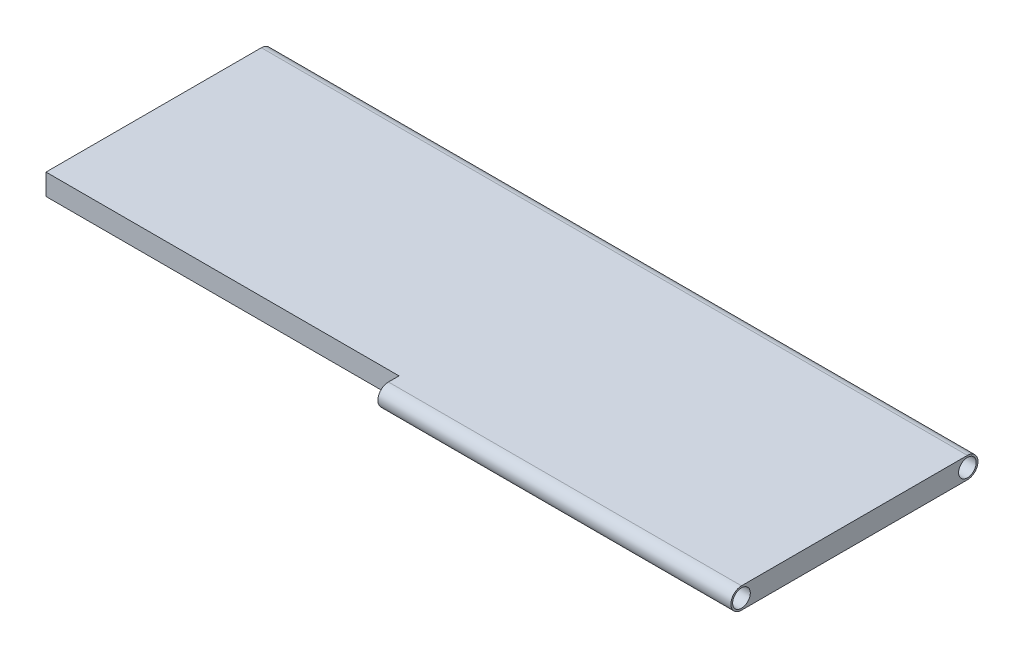
ISO-10303-21;
HEADER;
FILE_DESCRIPTION(('STEP AP214'),'2;1');
FILE_NAME('part.step','',(''),(''),'','','');
FILE_SCHEMA(('AUTOMOTIVE_DESIGN { 1 0 10303 214 1 1 1 1 }'));
ENDSEC;
DATA;
#1=APPLICATION_CONTEXT('core data for automotive mechanical design processes');
#2=APPLICATION_PROTOCOL_DEFINITION('international standard','automotive_design',2000,#1);
#3=PRODUCT_CONTEXT('',#1,'mechanical');
#4=PRODUCT('Part','Part','',(#3));
#5=PRODUCT_RELATED_PRODUCT_CATEGORY('part','',(#4));
#6=PRODUCT_DEFINITION_FORMATION('','',#4);
#7=PRODUCT_DEFINITION_CONTEXT('part definition',#1,'design');
#8=PRODUCT_DEFINITION('design','',#6,#7);
#9=PRODUCT_DEFINITION_SHAPE('','',#8);
#10=(LENGTH_UNIT() NAMED_UNIT(*) SI_UNIT(.MILLI.,.METRE.));
#11=(NAMED_UNIT(*) PLANE_ANGLE_UNIT() SI_UNIT($,.RADIAN.));
#12=(NAMED_UNIT(*) SI_UNIT($,.STERADIAN.) SOLID_ANGLE_UNIT());
#13=UNCERTAINTY_MEASURE_WITH_UNIT(LENGTH_MEASURE(1.E-05),#10,'distance_accuracy_value','');
#14=(GEOMETRIC_REPRESENTATION_CONTEXT(3) GLOBAL_UNCERTAINTY_ASSIGNED_CONTEXT((#13)) GLOBAL_UNIT_ASSIGNED_CONTEXT((#10,
#11,#12)) REPRESENTATION_CONTEXT('',''));
#15=CARTESIAN_POINT('',(0.,0.,0.));
#16=DIRECTION('',(0.,0.,1.));
#17=DIRECTION('',(1.,0.,0.));
#18=AXIS2_PLACEMENT_3D('',#15,#16,#17);
#19=CARTESIAN_POINT('',(-500.,30.,145.));
#20=DIRECTION('',(0.,0.,-1.));
#21=DIRECTION('',(-1.,0.,0.));
#22=AXIS2_PLACEMENT_3D('',#19,#20,#21);
#23=PLANE('',#22);
#24=DIRECTION('',(0.,-1.,0.));
#25=VECTOR('',#24,1.);
#26=CARTESIAN_POINT('',(0.,0.,145.));
#27=LINE('',#26,#25);
#28=CARTESIAN_POINT('',(0.,30.,145.));
#29=VERTEX_POINT('',#28);
#30=CARTESIAN_POINT('',(0.,0.,145.));
#31=VERTEX_POINT('',#30);
#32=EDGE_CURVE('E51',#29,#31,#27,.T.);
#33=ORIENTED_EDGE('',*,*,#32,.F.);
#34=DIRECTION('',(1.,0.,0.));
#35=VECTOR('',#34,1.);
#36=CARTESIAN_POINT('',(-500.,30.,145.));
#37=LINE('',#36,#35);
#38=CARTESIAN_POINT('',(-500.,30.,145.));
#39=VERTEX_POINT('',#38);
#40=EDGE_CURVE('E44',#39,#29,#37,.T.);
#41=ORIENTED_EDGE('',*,*,#40,.F.);
#42=DIRECTION('',(0.,-1.,0.));
#43=VECTOR('',#42,1.);
#44=CARTESIAN_POINT('',(-500.,30.,145.));
#45=LINE('',#44,#43);
#46=CARTESIAN_POINT('',(-500.,0.,145.));
#47=VERTEX_POINT('',#46);
#48=EDGE_CURVE('E11',#39,#47,#45,.T.);
#49=ORIENTED_EDGE('',*,*,#48,.T.);
#50=DIRECTION('',(1.,0.,0.));
#51=VECTOR('',#50,1.);
#52=CARTESIAN_POINT('',(-500.,0.,145.));
#53=LINE('',#52,#51);
#54=EDGE_CURVE('E96',#47,#31,#53,.T.);
#55=ORIENTED_EDGE('',*,*,#54,.T.);
#56=EDGE_LOOP('',(#33,#41,#49,#55));
#57=FACE_BOUND('',#56,.T.);
#58=ADVANCED_FACE('F36',(#57),#23,.F.);
#59=CARTESIAN_POINT('',(500.,30.,-145.));
#60=DIRECTION('',(-1.,0.,0.));
#61=DIRECTION('',(0.,0.,1.));
#62=AXIS2_PLACEMENT_3D('',#59,#60,#61);
#63=PLANE('',#62);
#64=DIRECTION('',(0.,0.,-1.));
#65=VECTOR('',#64,1.);
#66=CARTESIAN_POINT('',(500.,0.,-145.));
#67=LINE('',#66,#65);
#68=CARTESIAN_POINT('',(500.,0.,160.));
#69=VERTEX_POINT('',#68);
#70=CARTESIAN_POINT('',(500.,0.,-160.));
#71=VERTEX_POINT('',#70);
#72=EDGE_CURVE('E99',#69,#71,#67,.T.);
#73=ORIENTED_EDGE('',*,*,#72,.T.);
#74=CARTESIAN_POINT('',(500.,15.,-160.));
#75=DIRECTION('',(1.,0.,0.));
#76=DIRECTION('',(0.,0.,-1.));
#77=AXIS2_PLACEMENT_3D('',#74,#75,#76);
#78=CIRCLE('',#77,15.);
#79=CARTESIAN_POINT('',(500.,30.,-160.));
#80=VERTEX_POINT('',#79);
#81=EDGE_CURVE('E107',#71,#80,#78,.T.);
#82=ORIENTED_EDGE('',*,*,#81,.T.);
#83=DIRECTION('',(0.,0.,-1.));
#84=VECTOR('',#83,1.);
#85=CARTESIAN_POINT('',(500.,30.,-145.));
#86=LINE('',#85,#84);
#87=CARTESIAN_POINT('',(500.,30.,160.));
#88=VERTEX_POINT('',#87);
#89=EDGE_CURVE('E146',#88,#80,#86,.T.);
#90=ORIENTED_EDGE('',*,*,#89,.F.);
#91=CARTESIAN_POINT('',(500.,15.,160.));
#92=DIRECTION('',(1.,0.,0.));
#93=DIRECTION('',(0.,0.,-1.));
#94=AXIS2_PLACEMENT_3D('',#91,#92,#93);
#95=CIRCLE('',#94,15.);
#96=EDGE_CURVE('E121',#88,#69,#95,.T.);
#97=ORIENTED_EDGE('',*,*,#96,.T.);
#98=EDGE_LOOP('',(#73,#82,#90,#97));
#99=FACE_BOUND('',#98,.T.);
#100=CARTESIAN_POINT('',(500.,15.,160.));
#101=DIRECTION('',(1.,0.,0.));
#102=DIRECTION('',(0.,0.,-1.));
#103=AXIS2_PLACEMENT_3D('',#100,#101,#102);
#104=CIRCLE('',#103,12.5);
#105=CARTESIAN_POINT('',(500.,15.,147.5));
#106=VERTEX_POINT('',#105);
#107=EDGE_CURVE('E127',#106,#106,#104,.T.);
#108=ORIENTED_EDGE('',*,*,#107,.F.);
#109=EDGE_LOOP('',(#108));
#110=FACE_BOUND('',#109,.T.);
#111=CARTESIAN_POINT('',(500.,15.,-160.));
#112=DIRECTION('',(1.,0.,0.));
#113=DIRECTION('',(0.,0.,-1.));
#114=AXIS2_PLACEMENT_3D('',#111,#112,#113);
#115=CIRCLE('',#114,12.5);
#116=CARTESIAN_POINT('',(500.,15.,-172.5));
#117=VERTEX_POINT('',#116);
#118=EDGE_CURVE('E113',#117,#117,#115,.T.);
#119=ORIENTED_EDGE('',*,*,#118,.F.);
#120=EDGE_LOOP('',(#119));
#121=FACE_BOUND('',#120,.T.);
#122=ADVANCED_FACE('F38',(#99,#110,#121),#63,.F.);
#123=CARTESIAN_POINT('',(-500.,30.,-145.));
#124=DIRECTION('',(1.,0.,0.));
#125=DIRECTION('',(0.,0.,-1.));
#126=AXIS2_PLACEMENT_3D('',#123,#124,#125);
#127=PLANE('',#126);
#128=DIRECTION('',(0.,0.,1.));
#129=VECTOR('',#128,1.);
#130=CARTESIAN_POINT('',(-500.,0.,-145.));
#131=LINE('',#130,#129);
#132=CARTESIAN_POINT('',(-500.,0.,-160.));
#133=VERTEX_POINT('',#132);
#134=EDGE_CURVE('E90',#133,#47,#131,.T.);
#135=ORIENTED_EDGE('',*,*,#134,.T.);
#136=ORIENTED_EDGE('',*,*,#48,.F.);
#137=DIRECTION('',(0.,0.,1.));
#138=VECTOR('',#137,1.);
#139=CARTESIAN_POINT('',(-500.,30.,-145.));
#140=LINE('',#139,#138);
#141=CARTESIAN_POINT('',(-500.,30.,-160.));
#142=VERTEX_POINT('',#141);
#143=EDGE_CURVE('E59',#142,#39,#140,.T.);
#144=ORIENTED_EDGE('',*,*,#143,.F.);
#145=CARTESIAN_POINT('',(-500.,15.,-160.));
#146=DIRECTION('',(1.,0.,0.));
#147=DIRECTION('',(0.,0.,-1.));
#148=AXIS2_PLACEMENT_3D('',#145,#146,#147);
#149=CIRCLE('',#148,15.);
#150=EDGE_CURVE('E105',#133,#142,#149,.T.);
#151=ORIENTED_EDGE('',*,*,#150,.F.);
#152=EDGE_LOOP('',(#135,#136,#144,#151));
#153=FACE_BOUND('',#152,.T.);
#154=CARTESIAN_POINT('',(-500.,15.,-160.));
#155=DIRECTION('',(1.,0.,0.));
#156=DIRECTION('',(0.,0.,-1.));
#157=AXIS2_PLACEMENT_3D('',#154,#155,#156);
#158=CIRCLE('',#157,12.5);
#159=CARTESIAN_POINT('',(-500.,15.,-172.5));
#160=VERTEX_POINT('',#159);
#161=EDGE_CURVE('E109',#160,#160,#158,.T.);
#162=ORIENTED_EDGE('',*,*,#161,.T.);
#163=EDGE_LOOP('',(#162));
#164=FACE_BOUND('',#163,.T.);
#165=ADVANCED_FACE('F111',(#153,#164),#127,.F.);
#166=CARTESIAN_POINT('',(0.,30.,0.));
#167=DIRECTION('',(0.,1.,0.));
#168=DIRECTION('',(0.,0.,1.));
#169=AXIS2_PLACEMENT_3D('',#166,#167,#168);
#170=PLANE('',#169);
#171=ORIENTED_EDGE('',*,*,#89,.T.);
#172=DIRECTION('',(1.,0.,0.));
#173=VECTOR('',#172,1.);
#174=CARTESIAN_POINT('',(-500.,30.,-160.));
#175=LINE('',#174,#173);
#176=EDGE_CURVE('E108',#142,#80,#175,.T.);
#177=ORIENTED_EDGE('',*,*,#176,.F.);
#178=ORIENTED_EDGE('',*,*,#143,.T.);
#179=ORIENTED_EDGE('',*,*,#40,.T.);
#180=DIRECTION('',(0.,0.,-1.));
#181=VECTOR('',#180,1.);
#182=CARTESIAN_POINT('',(0.,30.,0.));
#183=LINE('',#182,#181);
#184=CARTESIAN_POINT('',(0.,30.,160.));
#185=VERTEX_POINT('',#184);
#186=EDGE_CURVE('E123',#185,#29,#183,.T.);
#187=ORIENTED_EDGE('',*,*,#186,.F.);
#188=DIRECTION('',(1.,0.,0.));
#189=VECTOR('',#188,1.);
#190=CARTESIAN_POINT('',(0.,30.,160.));
#191=LINE('',#190,#189);
#192=EDGE_CURVE('E136',#185,#88,#191,.T.);
#193=ORIENTED_EDGE('',*,*,#192,.T.);
#194=EDGE_LOOP('',(#171,#177,#178,#179,#187,#193));
#195=FACE_BOUND('',#194,.T.);
#196=ADVANCED_FACE('F161',(#195),#170,.T.);
#197=CARTESIAN_POINT('',(0.,0.,0.));
#198=DIRECTION('',(0.,1.,0.));
#199=DIRECTION('',(0.,0.,1.));
#200=AXIS2_PLACEMENT_3D('',#197,#198,#199);
#201=PLANE('',#200);
#202=ORIENTED_EDGE('',*,*,#72,.F.);
#203=DIRECTION('',(1.,0.,0.));
#204=VECTOR('',#203,1.);
#205=CARTESIAN_POINT('',(0.,0.,160.));
#206=LINE('',#205,#204);
#207=CARTESIAN_POINT('',(0.,0.,160.));
#208=VERTEX_POINT('',#207);
#209=EDGE_CURVE('E141',#208,#69,#206,.T.);
#210=ORIENTED_EDGE('',*,*,#209,.F.);
#211=DIRECTION('',(0.,0.,-1.));
#212=VECTOR('',#211,1.);
#213=CARTESIAN_POINT('',(0.,0.,0.));
#214=LINE('',#213,#212);
#215=EDGE_CURVE('E130',#208,#31,#214,.T.);
#216=ORIENTED_EDGE('',*,*,#215,.T.);
#217=ORIENTED_EDGE('',*,*,#54,.F.);
#218=ORIENTED_EDGE('',*,*,#134,.F.);
#219=DIRECTION('',(1.,0.,0.));
#220=VECTOR('',#219,1.);
#221=CARTESIAN_POINT('',(-500.,0.,-160.));
#222=LINE('',#221,#220);
#223=EDGE_CURVE('E93',#133,#71,#222,.T.);
#224=ORIENTED_EDGE('',*,*,#223,.T.);
#225=EDGE_LOOP('',(#202,#210,#216,#217,#218,#224));
#226=FACE_BOUND('',#225,.T.);
#227=ADVANCED_FACE('F92',(#226),#201,.F.);
#228=CARTESIAN_POINT('',(0.,15.,160.));
#229=DIRECTION('',(1.,0.,0.));
#230=DIRECTION('',(0.,0.,-1.));
#231=AXIS2_PLACEMENT_3D('',#228,#229,#230);
#232=CYLINDRICAL_SURFACE('',#231,15.);
#233=ORIENTED_EDGE('',*,*,#96,.F.);
#234=ORIENTED_EDGE('',*,*,#192,.F.);
#235=CARTESIAN_POINT('',(0.,15.,160.));
#236=DIRECTION('',(1.,0.,0.));
#237=DIRECTION('',(0.,0.,-1.));
#238=AXIS2_PLACEMENT_3D('',#235,#236,#237);
#239=CIRCLE('',#238,15.);
#240=EDGE_CURVE('E126',#185,#208,#239,.T.);
#241=ORIENTED_EDGE('',*,*,#240,.T.);
#242=ORIENTED_EDGE('',*,*,#209,.T.);
#243=EDGE_LOOP('',(#233,#234,#241,#242));
#244=FACE_BOUND('',#243,.T.);
#245=ADVANCED_FACE('F158',(#244),#232,.T.);
#246=CARTESIAN_POINT('',(0.,15.,160.));
#247=DIRECTION('',(1.,0.,0.));
#248=DIRECTION('',(0.,0.,-1.));
#249=AXIS2_PLACEMENT_3D('',#246,#247,#248);
#250=CYLINDRICAL_SURFACE('',#249,12.5);
#251=CARTESIAN_POINT('',(0.,15.,160.));
#252=DIRECTION('',(1.,0.,0.));
#253=DIRECTION('',(0.,0.,-1.));
#254=AXIS2_PLACEMENT_3D('',#251,#252,#253);
#255=CIRCLE('',#254,12.5);
#256=CARTESIAN_POINT('',(0.,15.,147.5));
#257=VERTEX_POINT('',#256);
#258=EDGE_CURVE('E133',#257,#257,#255,.T.);
#259=ORIENTED_EDGE('',*,*,#258,.F.);
#260=EDGE_LOOP('',(#259));
#261=FACE_BOUND('',#260,.T.);
#262=ORIENTED_EDGE('',*,*,#107,.T.);
#263=EDGE_LOOP('',(#262));
#264=FACE_BOUND('',#263,.T.);
#265=ADVANCED_FACE('F223',(#261,#264),#250,.F.);
#266=CARTESIAN_POINT('',(0.,0.,0.));
#267=DIRECTION('',(1.,0.,0.));
#268=DIRECTION('',(0.,0.,-1.));
#269=AXIS2_PLACEMENT_3D('',#266,#267,#268);
#270=PLANE('',#269);
#271=ORIENTED_EDGE('',*,*,#186,.T.);
#272=ORIENTED_EDGE('',*,*,#32,.T.);
#273=ORIENTED_EDGE('',*,*,#215,.F.);
#274=ORIENTED_EDGE('',*,*,#240,.F.);
#275=EDGE_LOOP('',(#271,#272,#273,#274));
#276=FACE_BOUND('',#275,.T.);
#277=ORIENTED_EDGE('',*,*,#258,.T.);
#278=EDGE_LOOP('',(#277));
#279=FACE_BOUND('',#278,.T.);
#280=ADVANCED_FACE('F152',(#276,#279),#270,.F.);
#281=CARTESIAN_POINT('',(-500.,15.,-160.));
#282=DIRECTION('',(1.,0.,0.));
#283=DIRECTION('',(0.,0.,-1.));
#284=AXIS2_PLACEMENT_3D('',#281,#282,#283);
#285=CYLINDRICAL_SURFACE('',#284,15.);
#286=ORIENTED_EDGE('',*,*,#81,.F.);
#287=ORIENTED_EDGE('',*,*,#223,.F.);
#288=ORIENTED_EDGE('',*,*,#150,.T.);
#289=ORIENTED_EDGE('',*,*,#176,.T.);
#290=EDGE_LOOP('',(#286,#287,#288,#289));
#291=FACE_BOUND('',#290,.T.);
#292=ADVANCED_FACE('F103',(#291),#285,.T.);
#293=CARTESIAN_POINT('',(-500.,15.,-160.));
#294=DIRECTION('',(1.,0.,0.));
#295=DIRECTION('',(0.,0.,-1.));
#296=AXIS2_PLACEMENT_3D('',#293,#294,#295);
#297=CYLINDRICAL_SURFACE('',#296,12.5);
#298=ORIENTED_EDGE('',*,*,#161,.F.);
#299=EDGE_LOOP('',(#298));
#300=FACE_BOUND('',#299,.T.);
#301=ORIENTED_EDGE('',*,*,#118,.T.);
#302=EDGE_LOOP('',(#301));
#303=FACE_BOUND('',#302,.T.);
#304=ADVANCED_FACE('F205',(#300,#303),#297,.F.);
#305=CLOSED_SHELL('',(#58,#122,#165,#196,#227,#245,#265,#280,#292,#304));
#306=MANIFOLD_SOLID_BREP('B2',#305);
#307=ADVANCED_BREP_SHAPE_REPRESENTATION('',(#18,#306),#14);
#308=SHAPE_DEFINITION_REPRESENTATION(#9,#307);
ENDSEC;
END-ISO-10303-21;
